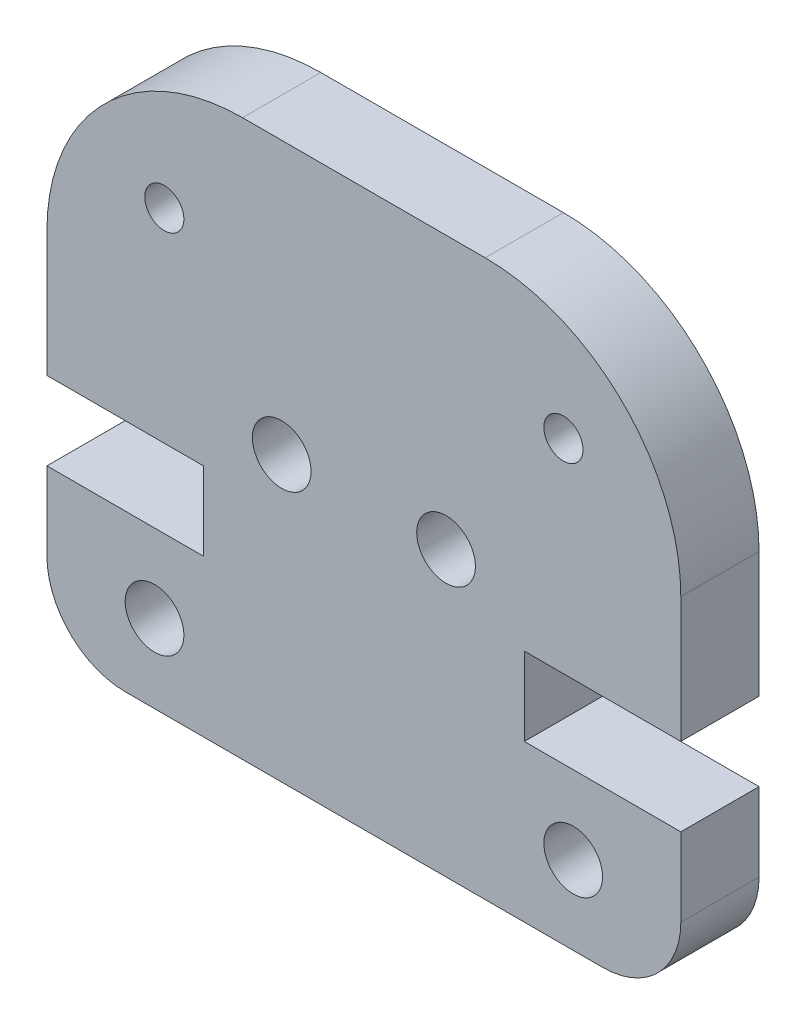
ISO-10303-21;
HEADER;
FILE_DESCRIPTION(('STEP AP214'),'2;1');
FILE_NAME('part.step','',(''),(''),'','','');
FILE_SCHEMA(('AUTOMOTIVE_DESIGN { 1 0 10303 214 1 1 1 1 }'));
ENDSEC;
DATA;
#1=APPLICATION_CONTEXT('core data for automotive mechanical design processes');
#2=APPLICATION_PROTOCOL_DEFINITION('international standard','automotive_design',2000,#1);
#3=PRODUCT_CONTEXT('',#1,'mechanical');
#4=PRODUCT('Part','Part','',(#3));
#5=PRODUCT_RELATED_PRODUCT_CATEGORY('part','',(#4));
#6=PRODUCT_DEFINITION_FORMATION('','',#4);
#7=PRODUCT_DEFINITION_CONTEXT('part definition',#1,'design');
#8=PRODUCT_DEFINITION('design','',#6,#7);
#9=PRODUCT_DEFINITION_SHAPE('','',#8);
#10=(LENGTH_UNIT() NAMED_UNIT(*) SI_UNIT(.MILLI.,.METRE.));
#11=(NAMED_UNIT(*) PLANE_ANGLE_UNIT() SI_UNIT($,.RADIAN.));
#12=(NAMED_UNIT(*) SI_UNIT($,.STERADIAN.) SOLID_ANGLE_UNIT());
#13=UNCERTAINTY_MEASURE_WITH_UNIT(LENGTH_MEASURE(1.E-05),#10,'distance_accuracy_value','');
#14=(GEOMETRIC_REPRESENTATION_CONTEXT(3) GLOBAL_UNCERTAINTY_ASSIGNED_CONTEXT((#13)) GLOBAL_UNIT_ASSIGNED_CONTEXT((#10,
#11,#12)) REPRESENTATION_CONTEXT('',''));
#15=CARTESIAN_POINT('',(0.,0.,0.));
#16=DIRECTION('',(0.,0.,1.));
#17=DIRECTION('',(1.,0.,0.));
#18=AXIS2_PLACEMENT_3D('',#15,#16,#17);
#19=CARTESIAN_POINT('',(14.2,2.00000000000002,2.));
#20=DIRECTION('',(0.,0.,-1.));
#21=DIRECTION('',(-1.,0.,0.));
#22=AXIS2_PLACEMENT_3D('',#19,#20,#21);
#23=PLANE('',#22);
#24=CARTESIAN_POINT('',(3.00000000000434,11.2049999999999,2.));
#25=DIRECTION('',(0.,0.,1.));
#26=DIRECTION('',(1.,0.,0.));
#27=AXIS2_PLACEMENT_3D('',#24,#25,#26);
#28=CIRCLE('',#27,0.499999999999944);
#29=CARTESIAN_POINT('',(3.50000000000429,11.2049999999999,2.));
#30=VERTEX_POINT('',#29);
#31=EDGE_CURVE('E352',#30,#30,#28,.T.);
#32=ORIENTED_EDGE('',*,*,#31,.F.);
#33=EDGE_LOOP('',(#32));
#34=FACE_BOUND('',#33,.T.);
#35=CARTESIAN_POINT('',(10.2000000000053,7.25000000000003,2.));
#36=DIRECTION('',(0.,0.,1.));
#37=DIRECTION('',(-1.,0.,0.));
#38=AXIS2_PLACEMENT_3D('',#35,#36,#37);
#39=CIRCLE('',#38,0.75);
#40=CARTESIAN_POINT('',(9.45000000000532,7.25000000000003,2.));
#41=VERTEX_POINT('',#40);
#42=EDGE_CURVE('E364',#41,#41,#39,.T.);
#43=ORIENTED_EDGE('',*,*,#42,.F.);
#44=EDGE_LOOP('',(#43));
#45=FACE_BOUND('',#44,.T.);
#46=CARTESIAN_POINT('',(13.45,2.00000000000002,2.));
#47=DIRECTION('',(0.,0.,1.));
#48=DIRECTION('',(-1.,0.,0.));
#49=AXIS2_PLACEMENT_3D('',#46,#47,#48);
#50=CIRCLE('',#49,0.750000000000008);
#51=CARTESIAN_POINT('',(12.7,2.00000000000002,2.));
#52=VERTEX_POINT('',#51);
#53=EDGE_CURVE('E182',#52,#52,#50,.T.);
#54=ORIENTED_EDGE('',*,*,#53,.F.);
#55=EDGE_LOOP('',(#54));
#56=FACE_BOUND('',#55,.T.);
#57=CARTESIAN_POINT('',(14.2,2.00000000000002,2.));
#58=DIRECTION('',(0.,0.,1.));
#59=DIRECTION('',(-1.,0.,0.));
#60=AXIS2_PLACEMENT_3D('',#57,#58,#59);
#61=CIRCLE('',#60,2.00000000000001);
#62=CARTESIAN_POINT('',(14.2,0.,2.));
#63=VERTEX_POINT('',#62);
#64=CARTESIAN_POINT('',(16.2,2.00000000000002,2.));
#65=VERTEX_POINT('',#64);
#66=EDGE_CURVE('E209',#63,#65,#61,.T.);
#67=ORIENTED_EDGE('',*,*,#66,.T.);
#68=DIRECTION('',(0.,1.,0.));
#69=VECTOR('',#68,1.);
#70=CARTESIAN_POINT('',(16.2,2.00000000000002,2.));
#71=LINE('',#70,#69);
#72=CARTESIAN_POINT('',(16.2,4.00000000000002,2.));
#73=VERTEX_POINT('',#72);
#74=EDGE_CURVE('E117',#65,#73,#71,.T.);
#75=ORIENTED_EDGE('',*,*,#74,.T.);
#76=DIRECTION('',(-1.,0.,0.));
#77=VECTOR('',#76,1.);
#78=CARTESIAN_POINT('',(12.2,4.00000000000002,2.));
#79=LINE('',#78,#77);
#80=CARTESIAN_POINT('',(12.2,4.00000000000002,2.));
#81=VERTEX_POINT('',#80);
#82=EDGE_CURVE('E248',#73,#81,#79,.T.);
#83=ORIENTED_EDGE('',*,*,#82,.T.);
#84=DIRECTION('',(0.,1.,0.));
#85=VECTOR('',#84,1.);
#86=CARTESIAN_POINT('',(12.2,6.00000000000003,2.));
#87=LINE('',#86,#85);
#88=CARTESIAN_POINT('',(12.2,6.00000000000003,2.));
#89=VERTEX_POINT('',#88);
#90=EDGE_CURVE('E267',#81,#89,#87,.T.);
#91=ORIENTED_EDGE('',*,*,#90,.T.);
#92=DIRECTION('',(1.,0.,0.));
#93=VECTOR('',#92,1.);
#94=CARTESIAN_POINT('',(16.2,6.00000000000003,2.));
#95=LINE('',#94,#93);
#96=CARTESIAN_POINT('',(16.2,6.00000000000003,2.));
#97=VERTEX_POINT('',#96);
#98=EDGE_CURVE('E264',#89,#97,#95,.T.);
#99=ORIENTED_EDGE('',*,*,#98,.T.);
#100=DIRECTION('',(0.,1.,0.));
#101=VECTOR('',#100,1.);
#102=CARTESIAN_POINT('',(16.2,9.205,2.));
#103=LINE('',#102,#101);
#104=CARTESIAN_POINT('',(16.2,9.205,2.));
#105=VERTEX_POINT('',#104);
#106=EDGE_CURVE('E266',#97,#105,#103,.T.);
#107=ORIENTED_EDGE('',*,*,#106,.T.);
#108=CARTESIAN_POINT('',(11.2,9.20499999999999,2.));
#109=DIRECTION('',(0.,0.,1.));
#110=DIRECTION('',(-1.,0.,0.));
#111=AXIS2_PLACEMENT_3D('',#108,#109,#110);
#112=CIRCLE('',#111,5.);
#113=CARTESIAN_POINT('',(11.2,14.205,2.));
#114=VERTEX_POINT('',#113);
#115=EDGE_CURVE('E269',#105,#114,#112,.T.);
#116=ORIENTED_EDGE('',*,*,#115,.T.);
#117=DIRECTION('',(-1.,0.,0.));
#118=VECTOR('',#117,1.);
#119=CARTESIAN_POINT('',(5.,14.205,2.));
#120=LINE('',#119,#118);
#121=CARTESIAN_POINT('',(5.,14.205,2.));
#122=VERTEX_POINT('',#121);
#123=EDGE_CURVE('E275',#114,#122,#120,.T.);
#124=ORIENTED_EDGE('',*,*,#123,.T.);
#125=CARTESIAN_POINT('',(5.,9.20499999999999,2.));
#126=DIRECTION('',(0.,0.,1.));
#127=DIRECTION('',(1.,0.,0.));
#128=AXIS2_PLACEMENT_3D('',#125,#126,#127);
#129=CIRCLE('',#128,5.);
#130=CARTESIAN_POINT('',(0.,9.20499999999999,2.));
#131=VERTEX_POINT('',#130);
#132=EDGE_CURVE('E277',#122,#131,#129,.T.);
#133=ORIENTED_EDGE('',*,*,#132,.T.);
#134=DIRECTION('',(0.,-1.,0.));
#135=VECTOR('',#134,1.);
#136=CARTESIAN_POINT('',(0.,9.20499999999999,2.));
#137=LINE('',#136,#135);
#138=CARTESIAN_POINT('',(0.,6.00000000000003,2.));
#139=VERTEX_POINT('',#138);
#140=EDGE_CURVE('E279',#131,#139,#137,.T.);
#141=ORIENTED_EDGE('',*,*,#140,.T.);
#142=DIRECTION('',(1.,0.,0.));
#143=VECTOR('',#142,1.);
#144=CARTESIAN_POINT('',(0.,6.00000000000003,2.));
#145=LINE('',#144,#143);
#146=CARTESIAN_POINT('',(4.00000000000001,6.00000000000003,2.));
#147=VERTEX_POINT('',#146);
#148=EDGE_CURVE('E281',#139,#147,#145,.T.);
#149=ORIENTED_EDGE('',*,*,#148,.T.);
#150=DIRECTION('',(0.,-1.,0.));
#151=VECTOR('',#150,1.);
#152=CARTESIAN_POINT('',(4.00000000000001,6.00000000000003,2.));
#153=LINE('',#152,#151);
#154=CARTESIAN_POINT('',(4.00000000000001,4.00000000000002,2.));
#155=VERTEX_POINT('',#154);
#156=EDGE_CURVE('E283',#147,#155,#153,.T.);
#157=ORIENTED_EDGE('',*,*,#156,.T.);
#158=DIRECTION('',(-1.,0.,0.));
#159=VECTOR('',#158,1.);
#160=CARTESIAN_POINT('',(4.00000000000001,4.00000000000002,2.));
#161=LINE('',#160,#159);
#162=CARTESIAN_POINT('',(0.,4.00000000000003,2.));
#163=VERTEX_POINT('',#162);
#164=EDGE_CURVE('E160',#155,#163,#161,.T.);
#165=ORIENTED_EDGE('',*,*,#164,.T.);
#166=DIRECTION('',(0.,-1.,0.));
#167=VECTOR('',#166,1.);
#168=CARTESIAN_POINT('',(0.,2.00000000000001,2.));
#169=LINE('',#168,#167);
#170=CARTESIAN_POINT('',(0.,2.00000000000001,2.));
#171=VERTEX_POINT('',#170);
#172=EDGE_CURVE('E154',#163,#171,#169,.T.);
#173=ORIENTED_EDGE('',*,*,#172,.T.);
#174=CARTESIAN_POINT('',(2.,2.00000000000001,2.));
#175=DIRECTION('',(0.,0.,1.));
#176=DIRECTION('',(1.,0.,0.));
#177=AXIS2_PLACEMENT_3D('',#174,#175,#176);
#178=CIRCLE('',#177,2.00000000000001);
#179=CARTESIAN_POINT('',(2.,0.,2.));
#180=VERTEX_POINT('',#179);
#181=EDGE_CURVE('E158',#171,#180,#178,.T.);
#182=ORIENTED_EDGE('',*,*,#181,.T.);
#183=DIRECTION('',(1.,0.,0.));
#184=VECTOR('',#183,1.);
#185=CARTESIAN_POINT('',(2.,0.,2.));
#186=LINE('',#185,#184);
#187=EDGE_CURVE('E50',#180,#63,#186,.T.);
#188=ORIENTED_EDGE('',*,*,#187,.T.);
#189=EDGE_LOOP('',(#67,#75,#83,#91,#99,#107,#116,#124,#133,#141,#149,#157,#165,#173,#182,#188));
#190=FACE_BOUND('',#189,.T.);
#191=CARTESIAN_POINT('',(13.1999999999957,11.2049999999999,2.));
#192=DIRECTION('',(0.,0.,1.));
#193=DIRECTION('',(-1.,0.,0.));
#194=AXIS2_PLACEMENT_3D('',#191,#192,#193);
#195=CIRCLE('',#194,0.499999999999945);
#196=CARTESIAN_POINT('',(12.6999999999957,11.2049999999999,2.));
#197=VERTEX_POINT('',#196);
#198=EDGE_CURVE('E370',#197,#197,#195,.T.);
#199=ORIENTED_EDGE('',*,*,#198,.F.);
#200=EDGE_LOOP('',(#199));
#201=FACE_BOUND('',#200,.T.);
#202=CARTESIAN_POINT('',(5.99999999999468,7.25000000000003,2.));
#203=DIRECTION('',(0.,0.,1.));
#204=DIRECTION('',(1.,0.,0.));
#205=AXIS2_PLACEMENT_3D('',#202,#203,#204);
#206=CIRCLE('',#205,0.75);
#207=CARTESIAN_POINT('',(6.74999999999468,7.25000000000003,2.));
#208=VERTEX_POINT('',#207);
#209=EDGE_CURVE('E358',#208,#208,#206,.T.);
#210=ORIENTED_EDGE('',*,*,#209,.F.);
#211=EDGE_LOOP('',(#210));
#212=FACE_BOUND('',#211,.T.);
#213=CARTESIAN_POINT('',(2.75,2.00000000000018,2.));
#214=DIRECTION('',(0.,0.,1.));
#215=DIRECTION('',(1.,0.,0.));
#216=AXIS2_PLACEMENT_3D('',#213,#214,#215);
#217=CIRCLE('',#216,0.750000000000887);
#218=CARTESIAN_POINT('',(3.50000000000089,2.00000000000018,2.));
#219=VERTEX_POINT('',#218);
#220=EDGE_CURVE('E343',#219,#219,#217,.T.);
#221=ORIENTED_EDGE('',*,*,#220,.F.);
#222=EDGE_LOOP('',(#221));
#223=FACE_BOUND('',#222,.T.);
#224=ADVANCED_FACE('F33',(#34,#45,#56,#190,#201,#212,#223),#23,.F.);
#225=CARTESIAN_POINT('',(14.2,2.00000000000002,0.));
#226=DIRECTION('',(0.,0.,-1.));
#227=DIRECTION('',(-1.,0.,0.));
#228=AXIS2_PLACEMENT_3D('',#225,#226,#227);
#229=PLANE('',#228);
#230=CARTESIAN_POINT('',(3.00000000000434,11.2049999999999,0.));
#231=DIRECTION('',(0.,0.,1.));
#232=DIRECTION('',(1.,0.,0.));
#233=AXIS2_PLACEMENT_3D('',#230,#231,#232);
#234=CIRCLE('',#233,0.499999999999944);
#235=CARTESIAN_POINT('',(3.50000000000429,11.2049999999999,0.));
#236=VERTEX_POINT('',#235);
#237=EDGE_CURVE('E349',#236,#236,#234,.T.);
#238=ORIENTED_EDGE('',*,*,#237,.T.);
#239=EDGE_LOOP('',(#238));
#240=FACE_BOUND('',#239,.T.);
#241=CARTESIAN_POINT('',(10.2000000000053,7.25000000000003,0.));
#242=DIRECTION('',(0.,0.,1.));
#243=DIRECTION('',(-1.,0.,0.));
#244=AXIS2_PLACEMENT_3D('',#241,#242,#243);
#245=CIRCLE('',#244,0.75);
#246=CARTESIAN_POINT('',(9.45000000000532,7.25000000000003,0.));
#247=VERTEX_POINT('',#246);
#248=EDGE_CURVE('E361',#247,#247,#245,.T.);
#249=ORIENTED_EDGE('',*,*,#248,.T.);
#250=EDGE_LOOP('',(#249));
#251=FACE_BOUND('',#250,.T.);
#252=CARTESIAN_POINT('',(13.45,2.00000000000002,0.));
#253=DIRECTION('',(0.,0.,1.));
#254=DIRECTION('',(-1.,0.,0.));
#255=AXIS2_PLACEMENT_3D('',#252,#253,#254);
#256=CIRCLE('',#255,0.750000000000008);
#257=CARTESIAN_POINT('',(12.7,2.00000000000002,0.));
#258=VERTEX_POINT('',#257);
#259=EDGE_CURVE('E373',#258,#258,#256,.T.);
#260=ORIENTED_EDGE('',*,*,#259,.T.);
#261=EDGE_LOOP('',(#260));
#262=FACE_BOUND('',#261,.T.);
#263=CARTESIAN_POINT('',(14.2,2.00000000000002,0.));
#264=DIRECTION('',(0.,0.,1.));
#265=DIRECTION('',(-1.,0.,0.));
#266=AXIS2_PLACEMENT_3D('',#263,#264,#265);
#267=CIRCLE('',#266,2.00000000000001);
#268=CARTESIAN_POINT('',(14.2,0.,0.));
#269=VERTEX_POINT('',#268);
#270=CARTESIAN_POINT('',(16.2,2.00000000000002,0.));
#271=VERTEX_POINT('',#270);
#272=EDGE_CURVE('E178',#269,#271,#267,.T.);
#273=ORIENTED_EDGE('',*,*,#272,.F.);
#274=DIRECTION('',(1.,0.,0.));
#275=VECTOR('',#274,1.);
#276=CARTESIAN_POINT('',(2.,0.,0.));
#277=LINE('',#276,#275);
#278=CARTESIAN_POINT('',(2.,0.,0.));
#279=VERTEX_POINT('',#278);
#280=EDGE_CURVE('E109',#279,#269,#277,.T.);
#281=ORIENTED_EDGE('',*,*,#280,.F.);
#282=CARTESIAN_POINT('',(2.,2.00000000000001,0.));
#283=DIRECTION('',(0.,0.,1.));
#284=DIRECTION('',(1.,0.,0.));
#285=AXIS2_PLACEMENT_3D('',#282,#283,#284);
#286=CIRCLE('',#285,2.00000000000001);
#287=CARTESIAN_POINT('',(0.,2.00000000000001,0.));
#288=VERTEX_POINT('',#287);
#289=EDGE_CURVE('E103',#288,#279,#286,.T.);
#290=ORIENTED_EDGE('',*,*,#289,.F.);
#291=DIRECTION('',(0.,-1.,0.));
#292=VECTOR('',#291,1.);
#293=CARTESIAN_POINT('',(0.,2.00000000000001,0.));
#294=LINE('',#293,#292);
#295=CARTESIAN_POINT('',(0.,4.00000000000003,0.));
#296=VERTEX_POINT('',#295);
#297=EDGE_CURVE('E168',#296,#288,#294,.T.);
#298=ORIENTED_EDGE('',*,*,#297,.F.);
#299=DIRECTION('',(-1.,0.,0.));
#300=VECTOR('',#299,1.);
#301=CARTESIAN_POINT('',(4.00000000000001,4.00000000000002,0.));
#302=LINE('',#301,#300);
#303=CARTESIAN_POINT('',(4.00000000000001,4.00000000000002,0.));
#304=VERTEX_POINT('',#303);
#305=EDGE_CURVE('E204',#304,#296,#302,.T.);
#306=ORIENTED_EDGE('',*,*,#305,.F.);
#307=DIRECTION('',(0.,-1.,0.));
#308=VECTOR('',#307,1.);
#309=CARTESIAN_POINT('',(4.00000000000001,6.00000000000003,0.));
#310=LINE('',#309,#308);
#311=CARTESIAN_POINT('',(4.00000000000001,6.00000000000003,0.));
#312=VERTEX_POINT('',#311);
#313=EDGE_CURVE('E202',#312,#304,#310,.T.);
#314=ORIENTED_EDGE('',*,*,#313,.F.);
#315=DIRECTION('',(1.,0.,0.));
#316=VECTOR('',#315,1.);
#317=CARTESIAN_POINT('',(0.,6.00000000000003,0.));
#318=LINE('',#317,#316);
#319=CARTESIAN_POINT('',(0.,6.00000000000003,0.));
#320=VERTEX_POINT('',#319);
#321=EDGE_CURVE('E200',#320,#312,#318,.T.);
#322=ORIENTED_EDGE('',*,*,#321,.F.);
#323=DIRECTION('',(0.,-1.,0.));
#324=VECTOR('',#323,1.);
#325=CARTESIAN_POINT('',(0.,9.20499999999999,0.));
#326=LINE('',#325,#324);
#327=CARTESIAN_POINT('',(0.,9.20499999999999,0.));
#328=VERTEX_POINT('',#327);
#329=EDGE_CURVE('E198',#328,#320,#326,.T.);
#330=ORIENTED_EDGE('',*,*,#329,.F.);
#331=CARTESIAN_POINT('',(5.,9.20499999999999,0.));
#332=DIRECTION('',(0.,0.,1.));
#333=DIRECTION('',(1.,0.,0.));
#334=AXIS2_PLACEMENT_3D('',#331,#332,#333);
#335=CIRCLE('',#334,5.);
#336=CARTESIAN_POINT('',(5.,14.205,0.));
#337=VERTEX_POINT('',#336);
#338=EDGE_CURVE('E196',#337,#328,#335,.T.);
#339=ORIENTED_EDGE('',*,*,#338,.F.);
#340=DIRECTION('',(-1.,0.,0.));
#341=VECTOR('',#340,1.);
#342=CARTESIAN_POINT('',(5.,14.205,0.));
#343=LINE('',#342,#341);
#344=CARTESIAN_POINT('',(11.2,14.205,0.));
#345=VERTEX_POINT('',#344);
#346=EDGE_CURVE('E194',#345,#337,#343,.T.);
#347=ORIENTED_EDGE('',*,*,#346,.F.);
#348=CARTESIAN_POINT('',(11.2,9.20499999999999,0.));
#349=DIRECTION('',(0.,0.,1.));
#350=DIRECTION('',(-1.,0.,0.));
#351=AXIS2_PLACEMENT_3D('',#348,#349,#350);
#352=CIRCLE('',#351,5.);
#353=CARTESIAN_POINT('',(16.2,9.205,0.));
#354=VERTEX_POINT('',#353);
#355=EDGE_CURVE('E192',#354,#345,#352,.T.);
#356=ORIENTED_EDGE('',*,*,#355,.F.);
#357=DIRECTION('',(0.,1.,0.));
#358=VECTOR('',#357,1.);
#359=CARTESIAN_POINT('',(16.2,9.205,0.));
#360=LINE('',#359,#358);
#361=CARTESIAN_POINT('',(16.2,6.00000000000003,0.));
#362=VERTEX_POINT('',#361);
#363=EDGE_CURVE('E190',#362,#354,#360,.T.);
#364=ORIENTED_EDGE('',*,*,#363,.F.);
#365=DIRECTION('',(1.,0.,0.));
#366=VECTOR('',#365,1.);
#367=CARTESIAN_POINT('',(16.2,6.00000000000003,0.));
#368=LINE('',#367,#366);
#369=CARTESIAN_POINT('',(12.2,6.00000000000003,0.));
#370=VERTEX_POINT('',#369);
#371=EDGE_CURVE('E188',#370,#362,#368,.T.);
#372=ORIENTED_EDGE('',*,*,#371,.F.);
#373=DIRECTION('',(0.,1.,0.));
#374=VECTOR('',#373,1.);
#375=CARTESIAN_POINT('',(12.2,6.00000000000003,0.));
#376=LINE('',#375,#374);
#377=CARTESIAN_POINT('',(12.2,4.00000000000002,0.));
#378=VERTEX_POINT('',#377);
#379=EDGE_CURVE('E186',#378,#370,#376,.T.);
#380=ORIENTED_EDGE('',*,*,#379,.F.);
#381=DIRECTION('',(-1.,0.,0.));
#382=VECTOR('',#381,1.);
#383=CARTESIAN_POINT('',(12.2,4.00000000000002,0.));
#384=LINE('',#383,#382);
#385=CARTESIAN_POINT('',(16.2,4.00000000000002,0.));
#386=VERTEX_POINT('',#385);
#387=EDGE_CURVE('E184',#386,#378,#384,.T.);
#388=ORIENTED_EDGE('',*,*,#387,.F.);
#389=DIRECTION('',(0.,1.,0.));
#390=VECTOR('',#389,1.);
#391=CARTESIAN_POINT('',(16.2,2.00000000000002,0.));
#392=LINE('',#391,#390);
#393=EDGE_CURVE('E181',#271,#386,#392,.T.);
#394=ORIENTED_EDGE('',*,*,#393,.F.);
#395=EDGE_LOOP('',(#273,#281,#290,#298,#306,#314,#322,#330,#339,#347,#356,#364,#372,#380,#388,#394));
#396=FACE_BOUND('',#395,.T.);
#397=CARTESIAN_POINT('',(13.1999999999957,11.2049999999999,0.));
#398=DIRECTION('',(0.,0.,1.));
#399=DIRECTION('',(-1.,0.,0.));
#400=AXIS2_PLACEMENT_3D('',#397,#398,#399);
#401=CIRCLE('',#400,0.499999999999945);
#402=CARTESIAN_POINT('',(12.6999999999957,11.2049999999999,0.));
#403=VERTEX_POINT('',#402);
#404=EDGE_CURVE('E367',#403,#403,#401,.T.);
#405=ORIENTED_EDGE('',*,*,#404,.T.);
#406=EDGE_LOOP('',(#405));
#407=FACE_BOUND('',#406,.T.);
#408=CARTESIAN_POINT('',(5.99999999999468,7.25000000000003,0.));
#409=DIRECTION('',(0.,0.,1.));
#410=DIRECTION('',(1.,0.,0.));
#411=AXIS2_PLACEMENT_3D('',#408,#409,#410);
#412=CIRCLE('',#411,0.75);
#413=CARTESIAN_POINT('',(6.74999999999468,7.25000000000003,0.));
#414=VERTEX_POINT('',#413);
#415=EDGE_CURVE('E355',#414,#414,#412,.T.);
#416=ORIENTED_EDGE('',*,*,#415,.T.);
#417=EDGE_LOOP('',(#416));
#418=FACE_BOUND('',#417,.T.);
#419=CARTESIAN_POINT('',(2.75,2.00000000000018,0.));
#420=DIRECTION('',(0.,0.,1.));
#421=DIRECTION('',(1.,0.,0.));
#422=AXIS2_PLACEMENT_3D('',#419,#420,#421);
#423=CIRCLE('',#422,0.750000000000887);
#424=CARTESIAN_POINT('',(3.50000000000089,2.00000000000018,0.));
#425=VERTEX_POINT('',#424);
#426=EDGE_CURVE('E346',#425,#425,#423,.T.);
#427=ORIENTED_EDGE('',*,*,#426,.T.);
#428=EDGE_LOOP('',(#427));
#429=FACE_BOUND('',#428,.T.);
#430=ADVANCED_FACE('F252',(#240,#251,#262,#396,#407,#418,#429),#229,.T.);
#431=CARTESIAN_POINT('',(14.2,2.00000000000002,2.));
#432=DIRECTION('',(0.,0.,-1.));
#433=DIRECTION('',(-1.,0.,0.));
#434=AXIS2_PLACEMENT_3D('',#431,#432,#433);
#435=CYLINDRICAL_SURFACE('',#434,2.00000000000001);
#436=ORIENTED_EDGE('',*,*,#272,.T.);
#437=DIRECTION('',(0.,0.,-1.));
#438=VECTOR('',#437,1.);
#439=CARTESIAN_POINT('',(16.2,2.00000000000002,2.));
#440=LINE('',#439,#438);
#441=EDGE_CURVE('E11',#65,#271,#440,.T.);
#442=ORIENTED_EDGE('',*,*,#441,.F.);
#443=ORIENTED_EDGE('',*,*,#66,.F.);
#444=DIRECTION('',(0.,0.,-1.));
#445=VECTOR('',#444,1.);
#446=CARTESIAN_POINT('',(14.2,0.,2.));
#447=LINE('',#446,#445);
#448=EDGE_CURVE('E174',#63,#269,#447,.T.);
#449=ORIENTED_EDGE('',*,*,#448,.T.);
#450=EDGE_LOOP('',(#436,#442,#443,#449));
#451=FACE_BOUND('',#450,.T.);
#452=ADVANCED_FACE('F35',(#451),#435,.T.);
#453=CARTESIAN_POINT('',(16.2,2.00000000000002,2.));
#454=DIRECTION('',(-1.,0.,0.));
#455=DIRECTION('',(0.,0.,1.));
#456=AXIS2_PLACEMENT_3D('',#453,#454,#455);
#457=PLANE('',#456);
#458=ORIENTED_EDGE('',*,*,#393,.T.);
#459=DIRECTION('',(0.,0.,-1.));
#460=VECTOR('',#459,1.);
#461=CARTESIAN_POINT('',(16.2,4.00000000000002,2.));
#462=LINE('',#461,#460);
#463=EDGE_CURVE('E42',#73,#386,#462,.T.);
#464=ORIENTED_EDGE('',*,*,#463,.F.);
#465=ORIENTED_EDGE('',*,*,#74,.F.);
#466=ORIENTED_EDGE('',*,*,#441,.T.);
#467=EDGE_LOOP('',(#458,#464,#465,#466));
#468=FACE_BOUND('',#467,.T.);
#469=ADVANCED_FACE('F540',(#468),#457,.F.);
#470=CARTESIAN_POINT('',(12.2,4.00000000000002,2.));
#471=DIRECTION('',(0.,-1.,0.));
#472=DIRECTION('',(1.,0.,0.));
#473=AXIS2_PLACEMENT_3D('',#470,#471,#472);
#474=PLANE('',#473);
#475=ORIENTED_EDGE('',*,*,#387,.T.);
#476=DIRECTION('',(0.,0.,-1.));
#477=VECTOR('',#476,1.);
#478=CARTESIAN_POINT('',(12.2,4.00000000000002,2.));
#479=LINE('',#478,#477);
#480=EDGE_CURVE('E240',#81,#378,#479,.T.);
#481=ORIENTED_EDGE('',*,*,#480,.F.);
#482=ORIENTED_EDGE('',*,*,#82,.F.);
#483=ORIENTED_EDGE('',*,*,#463,.T.);
#484=EDGE_LOOP('',(#475,#481,#482,#483));
#485=FACE_BOUND('',#484,.T.);
#486=ADVANCED_FACE('F246',(#485),#474,.F.);
#487=CARTESIAN_POINT('',(12.2,6.00000000000003,2.));
#488=DIRECTION('',(-1.,0.,0.));
#489=DIRECTION('',(0.,-1.,0.));
#490=AXIS2_PLACEMENT_3D('',#487,#488,#489);
#491=PLANE('',#490);
#492=ORIENTED_EDGE('',*,*,#379,.T.);
#493=DIRECTION('',(0.,0.,-1.));
#494=VECTOR('',#493,1.);
#495=CARTESIAN_POINT('',(12.2,6.00000000000003,2.));
#496=LINE('',#495,#494);
#497=EDGE_CURVE('E237',#89,#370,#496,.T.);
#498=ORIENTED_EDGE('',*,*,#497,.F.);
#499=ORIENTED_EDGE('',*,*,#90,.F.);
#500=ORIENTED_EDGE('',*,*,#480,.T.);
#501=EDGE_LOOP('',(#492,#498,#499,#500));
#502=FACE_BOUND('',#501,.T.);
#503=ADVANCED_FACE('F258',(#502),#491,.F.);
#504=CARTESIAN_POINT('',(16.2,6.00000000000003,2.));
#505=DIRECTION('',(0.,1.,0.));
#506=DIRECTION('',(-1.,0.,0.));
#507=AXIS2_PLACEMENT_3D('',#504,#505,#506);
#508=PLANE('',#507);
#509=ORIENTED_EDGE('',*,*,#371,.T.);
#510=DIRECTION('',(0.,0.,-1.));
#511=VECTOR('',#510,1.);
#512=CARTESIAN_POINT('',(16.2,6.00000000000003,2.));
#513=LINE('',#512,#511);
#514=EDGE_CURVE('E234',#97,#362,#513,.T.);
#515=ORIENTED_EDGE('',*,*,#514,.F.);
#516=ORIENTED_EDGE('',*,*,#98,.F.);
#517=ORIENTED_EDGE('',*,*,#497,.T.);
#518=EDGE_LOOP('',(#509,#515,#516,#517));
#519=FACE_BOUND('',#518,.T.);
#520=ADVANCED_FACE('F262',(#519),#508,.F.);
#521=CARTESIAN_POINT('',(16.2,9.205,2.));
#522=DIRECTION('',(-1.,0.,0.));
#523=DIRECTION('',(0.,-1.,0.));
#524=AXIS2_PLACEMENT_3D('',#521,#522,#523);
#525=PLANE('',#524);
#526=ORIENTED_EDGE('',*,*,#363,.T.);
#527=DIRECTION('',(0.,0.,-1.));
#528=VECTOR('',#527,1.);
#529=CARTESIAN_POINT('',(16.2,9.205,2.));
#530=LINE('',#529,#528);
#531=EDGE_CURVE('E231',#105,#354,#530,.T.);
#532=ORIENTED_EDGE('',*,*,#531,.F.);
#533=ORIENTED_EDGE('',*,*,#106,.F.);
#534=ORIENTED_EDGE('',*,*,#514,.T.);
#535=EDGE_LOOP('',(#526,#532,#533,#534));
#536=FACE_BOUND('',#535,.T.);
#537=ADVANCED_FACE('F505',(#536),#525,.F.);
#538=CARTESIAN_POINT('',(11.2,9.20499999999999,2.));
#539=DIRECTION('',(0.,0.,-1.));
#540=DIRECTION('',(-1.,0.,0.));
#541=AXIS2_PLACEMENT_3D('',#538,#539,#540);
#542=CYLINDRICAL_SURFACE('',#541,5.);
#543=ORIENTED_EDGE('',*,*,#355,.T.);
#544=DIRECTION('',(0.,0.,-1.));
#545=VECTOR('',#544,1.);
#546=CARTESIAN_POINT('',(11.2,14.205,2.));
#547=LINE('',#546,#545);
#548=EDGE_CURVE('E228',#114,#345,#547,.T.);
#549=ORIENTED_EDGE('',*,*,#548,.F.);
#550=ORIENTED_EDGE('',*,*,#115,.F.);
#551=ORIENTED_EDGE('',*,*,#531,.T.);
#552=EDGE_LOOP('',(#543,#549,#550,#551));
#553=FACE_BOUND('',#552,.T.);
#554=ADVANCED_FACE('F495',(#553),#542,.T.);
#555=CARTESIAN_POINT('',(5.,14.205,2.));
#556=DIRECTION('',(0.,-1.,0.));
#557=DIRECTION('',(0.,0.,-1.));
#558=AXIS2_PLACEMENT_3D('',#555,#556,#557);
#559=PLANE('',#558);
#560=ORIENTED_EDGE('',*,*,#346,.T.);
#561=DIRECTION('',(0.,0.,-1.));
#562=VECTOR('',#561,1.);
#563=CARTESIAN_POINT('',(5.,14.205,2.));
#564=LINE('',#563,#562);
#565=EDGE_CURVE('E225',#122,#337,#564,.T.);
#566=ORIENTED_EDGE('',*,*,#565,.F.);
#567=ORIENTED_EDGE('',*,*,#123,.F.);
#568=ORIENTED_EDGE('',*,*,#548,.T.);
#569=EDGE_LOOP('',(#560,#566,#567,#568));
#570=FACE_BOUND('',#569,.T.);
#571=ADVANCED_FACE('F485',(#570),#559,.F.);
#572=CARTESIAN_POINT('',(5.,9.20499999999999,2.));
#573=DIRECTION('',(0.,0.,-1.));
#574=DIRECTION('',(-1.,0.,0.));
#575=AXIS2_PLACEMENT_3D('',#572,#573,#574);
#576=CYLINDRICAL_SURFACE('',#575,5.);
#577=ORIENTED_EDGE('',*,*,#338,.T.);
#578=DIRECTION('',(0.,0.,-1.));
#579=VECTOR('',#578,1.);
#580=CARTESIAN_POINT('',(0.,9.20499999999999,2.));
#581=LINE('',#580,#579);
#582=EDGE_CURVE('E222',#131,#328,#581,.T.);
#583=ORIENTED_EDGE('',*,*,#582,.F.);
#584=ORIENTED_EDGE('',*,*,#132,.F.);
#585=ORIENTED_EDGE('',*,*,#565,.T.);
#586=EDGE_LOOP('',(#577,#583,#584,#585));
#587=FACE_BOUND('',#586,.T.);
#588=ADVANCED_FACE('F475',(#587),#576,.T.);
#589=CARTESIAN_POINT('',(0.,9.20499999999999,2.));
#590=DIRECTION('',(1.,0.,0.));
#591=DIRECTION('',(0.,0.,-1.));
#592=AXIS2_PLACEMENT_3D('',#589,#590,#591);
#593=PLANE('',#592);
#594=ORIENTED_EDGE('',*,*,#329,.T.);
#595=DIRECTION('',(0.,0.,-1.));
#596=VECTOR('',#595,1.);
#597=CARTESIAN_POINT('',(0.,6.00000000000003,2.));
#598=LINE('',#597,#596);
#599=EDGE_CURVE('E219',#139,#320,#598,.T.);
#600=ORIENTED_EDGE('',*,*,#599,.F.);
#601=ORIENTED_EDGE('',*,*,#140,.F.);
#602=ORIENTED_EDGE('',*,*,#582,.T.);
#603=EDGE_LOOP('',(#594,#600,#601,#602));
#604=FACE_BOUND('',#603,.T.);
#605=ADVANCED_FACE('F465',(#604),#593,.F.);
#606=CARTESIAN_POINT('',(0.,6.00000000000003,2.));
#607=DIRECTION('',(0.,1.,0.));
#608=DIRECTION('',(-1.,0.,0.));
#609=AXIS2_PLACEMENT_3D('',#606,#607,#608);
#610=PLANE('',#609);
#611=ORIENTED_EDGE('',*,*,#321,.T.);
#612=DIRECTION('',(0.,0.,-1.));
#613=VECTOR('',#612,1.);
#614=CARTESIAN_POINT('',(4.00000000000001,6.00000000000003,2.));
#615=LINE('',#614,#613);
#616=EDGE_CURVE('E216',#147,#312,#615,.T.);
#617=ORIENTED_EDGE('',*,*,#616,.F.);
#618=ORIENTED_EDGE('',*,*,#148,.F.);
#619=ORIENTED_EDGE('',*,*,#599,.T.);
#620=EDGE_LOOP('',(#611,#617,#618,#619));
#621=FACE_BOUND('',#620,.T.);
#622=ADVANCED_FACE('F456',(#621),#610,.F.);
#623=CARTESIAN_POINT('',(4.00000000000001,6.00000000000003,2.));
#624=DIRECTION('',(1.,0.,0.));
#625=DIRECTION('',(0.,0.,-1.));
#626=AXIS2_PLACEMENT_3D('',#623,#624,#625);
#627=PLANE('',#626);
#628=ORIENTED_EDGE('',*,*,#313,.T.);
#629=DIRECTION('',(0.,0.,-1.));
#630=VECTOR('',#629,1.);
#631=CARTESIAN_POINT('',(4.00000000000001,4.00000000000002,2.));
#632=LINE('',#631,#630);
#633=EDGE_CURVE('E213',#155,#304,#632,.T.);
#634=ORIENTED_EDGE('',*,*,#633,.F.);
#635=ORIENTED_EDGE('',*,*,#156,.F.);
#636=ORIENTED_EDGE('',*,*,#616,.T.);
#637=EDGE_LOOP('',(#628,#634,#635,#636));
#638=FACE_BOUND('',#637,.T.);
#639=ADVANCED_FACE('F289',(#638),#627,.F.);
#640=CARTESIAN_POINT('',(4.00000000000001,4.00000000000002,2.));
#641=DIRECTION('',(0.,-1.,0.));
#642=DIRECTION('',(1.,0.,0.));
#643=AXIS2_PLACEMENT_3D('',#640,#641,#642);
#644=PLANE('',#643);
#645=ORIENTED_EDGE('',*,*,#305,.T.);
#646=DIRECTION('',(0.,0.,-1.));
#647=VECTOR('',#646,1.);
#648=CARTESIAN_POINT('',(0.,4.00000000000003,2.));
#649=LINE('',#648,#647);
#650=EDGE_CURVE('E169',#163,#296,#649,.T.);
#651=ORIENTED_EDGE('',*,*,#650,.F.);
#652=ORIENTED_EDGE('',*,*,#164,.F.);
#653=ORIENTED_EDGE('',*,*,#633,.T.);
#654=EDGE_LOOP('',(#645,#651,#652,#653));
#655=FACE_BOUND('',#654,.T.);
#656=ADVANCED_FACE('F293',(#655),#644,.F.);
#657=CARTESIAN_POINT('',(0.,2.00000000000001,2.));
#658=DIRECTION('',(1.,0.,0.));
#659=DIRECTION('',(0.,0.,-1.));
#660=AXIS2_PLACEMENT_3D('',#657,#658,#659);
#661=PLANE('',#660);
#662=ORIENTED_EDGE('',*,*,#297,.T.);
#663=DIRECTION('',(0.,0.,-1.));
#664=VECTOR('',#663,1.);
#665=CARTESIAN_POINT('',(0.,2.00000000000001,2.));
#666=LINE('',#665,#664);
#667=EDGE_CURVE('E165',#171,#288,#666,.T.);
#668=ORIENTED_EDGE('',*,*,#667,.F.);
#669=ORIENTED_EDGE('',*,*,#172,.F.);
#670=ORIENTED_EDGE('',*,*,#650,.T.);
#671=EDGE_LOOP('',(#662,#668,#669,#670));
#672=FACE_BOUND('',#671,.T.);
#673=ADVANCED_FACE('F166',(#672),#661,.F.);
#674=CARTESIAN_POINT('',(2.,2.00000000000001,2.));
#675=DIRECTION('',(0.,0.,-1.));
#676=DIRECTION('',(-1.,0.,0.));
#677=AXIS2_PLACEMENT_3D('',#674,#675,#676);
#678=CYLINDRICAL_SURFACE('',#677,2.00000000000001);
#679=ORIENTED_EDGE('',*,*,#289,.T.);
#680=DIRECTION('',(0.,0.,-1.));
#681=VECTOR('',#680,1.);
#682=CARTESIAN_POINT('',(2.,0.,2.));
#683=LINE('',#682,#681);
#684=EDGE_CURVE('E170',#180,#279,#683,.T.);
#685=ORIENTED_EDGE('',*,*,#684,.F.);
#686=ORIENTED_EDGE('',*,*,#181,.F.);
#687=ORIENTED_EDGE('',*,*,#667,.T.);
#688=EDGE_LOOP('',(#679,#685,#686,#687));
#689=FACE_BOUND('',#688,.T.);
#690=ADVANCED_FACE('F172',(#689),#678,.T.);
#691=CARTESIAN_POINT('',(2.,0.,2.));
#692=DIRECTION('',(0.,1.,0.));
#693=DIRECTION('',(-1.,0.,0.));
#694=AXIS2_PLACEMENT_3D('',#691,#692,#693);
#695=PLANE('',#694);
#696=ORIENTED_EDGE('',*,*,#280,.T.);
#697=ORIENTED_EDGE('',*,*,#448,.F.);
#698=ORIENTED_EDGE('',*,*,#187,.F.);
#699=ORIENTED_EDGE('',*,*,#684,.T.);
#700=EDGE_LOOP('',(#696,#697,#698,#699));
#701=FACE_BOUND('',#700,.T.);
#702=ADVANCED_FACE('F297',(#701),#695,.F.);
#703=CARTESIAN_POINT('',(13.45,2.00000000000002,2.));
#704=DIRECTION('',(0.,0.,-1.));
#705=DIRECTION('',(-1.,0.,0.));
#706=AXIS2_PLACEMENT_3D('',#703,#704,#705);
#707=CYLINDRICAL_SURFACE('',#706,0.750000000000008);
#708=ORIENTED_EDGE('',*,*,#53,.T.);
#709=EDGE_LOOP('',(#708));
#710=FACE_BOUND('',#709,.T.);
#711=ORIENTED_EDGE('',*,*,#259,.F.);
#712=EDGE_LOOP('',(#711));
#713=FACE_BOUND('',#712,.T.);
#714=ADVANCED_FACE('F299',(#710,#713),#707,.F.);
#715=CARTESIAN_POINT('',(13.1999999999957,11.2049999999999,2.));
#716=DIRECTION('',(0.,0.,-1.));
#717=DIRECTION('',(-1.,0.,0.));
#718=AXIS2_PLACEMENT_3D('',#715,#716,#717);
#719=CYLINDRICAL_SURFACE('',#718,0.499999999999945);
#720=ORIENTED_EDGE('',*,*,#198,.T.);
#721=EDGE_LOOP('',(#720));
#722=FACE_BOUND('',#721,.T.);
#723=ORIENTED_EDGE('',*,*,#404,.F.);
#724=EDGE_LOOP('',(#723));
#725=FACE_BOUND('',#724,.T.);
#726=ADVANCED_FACE('F305',(#722,#725),#719,.F.);
#727=CARTESIAN_POINT('',(10.2000000000053,7.25000000000003,2.));
#728=DIRECTION('',(0.,0.,-1.));
#729=DIRECTION('',(-1.,0.,0.));
#730=AXIS2_PLACEMENT_3D('',#727,#728,#729);
#731=CYLINDRICAL_SURFACE('',#730,0.75);
#732=ORIENTED_EDGE('',*,*,#42,.T.);
#733=EDGE_LOOP('',(#732));
#734=FACE_BOUND('',#733,.T.);
#735=ORIENTED_EDGE('',*,*,#248,.F.);
#736=EDGE_LOOP('',(#735));
#737=FACE_BOUND('',#736,.T.);
#738=ADVANCED_FACE('F322',(#734,#737),#731,.F.);
#739=CARTESIAN_POINT('',(5.99999999999468,7.25000000000003,2.));
#740=DIRECTION('',(0.,0.,-1.));
#741=DIRECTION('',(-1.,0.,0.));
#742=AXIS2_PLACEMENT_3D('',#739,#740,#741);
#743=CYLINDRICAL_SURFACE('',#742,0.75);
#744=ORIENTED_EDGE('',*,*,#209,.T.);
#745=EDGE_LOOP('',(#744));
#746=FACE_BOUND('',#745,.T.);
#747=ORIENTED_EDGE('',*,*,#415,.F.);
#748=EDGE_LOOP('',(#747));
#749=FACE_BOUND('',#748,.T.);
#750=ADVANCED_FACE('F326',(#746,#749),#743,.F.);
#751=CARTESIAN_POINT('',(3.00000000000434,11.2049999999999,2.));
#752=DIRECTION('',(0.,0.,-1.));
#753=DIRECTION('',(-1.,0.,0.));
#754=AXIS2_PLACEMENT_3D('',#751,#752,#753);
#755=CYLINDRICAL_SURFACE('',#754,0.499999999999944);
#756=ORIENTED_EDGE('',*,*,#31,.T.);
#757=EDGE_LOOP('',(#756));
#758=FACE_BOUND('',#757,.T.);
#759=ORIENTED_EDGE('',*,*,#237,.F.);
#760=EDGE_LOOP('',(#759));
#761=FACE_BOUND('',#760,.T.);
#762=ADVANCED_FACE('F330',(#758,#761),#755,.F.);
#763=CARTESIAN_POINT('',(2.75,2.00000000000018,2.));
#764=DIRECTION('',(0.,0.,-1.));
#765=DIRECTION('',(-1.,0.,0.));
#766=AXIS2_PLACEMENT_3D('',#763,#764,#765);
#767=CYLINDRICAL_SURFACE('',#766,0.750000000000887);
#768=ORIENTED_EDGE('',*,*,#220,.T.);
#769=EDGE_LOOP('',(#768));
#770=FACE_BOUND('',#769,.T.);
#771=ORIENTED_EDGE('',*,*,#426,.F.);
#772=EDGE_LOOP('',(#771));
#773=FACE_BOUND('',#772,.T.);
#774=ADVANCED_FACE('F334',(#770,#773),#767,.F.);
#775=CLOSED_SHELL('',(#224,#430,#452,#469,#486,#503,#520,#537,#554,#571,#588,#605,#622,#639,
#656,#673,#690,#702,#714,#726,#738,#750,#762,#774));
#776=MANIFOLD_SOLID_BREP('B2',#775);
#777=ADVANCED_BREP_SHAPE_REPRESENTATION('',(#18,#776),#14);
#778=SHAPE_DEFINITION_REPRESENTATION(#9,#777);
ENDSEC;
END-ISO-10303-21;
